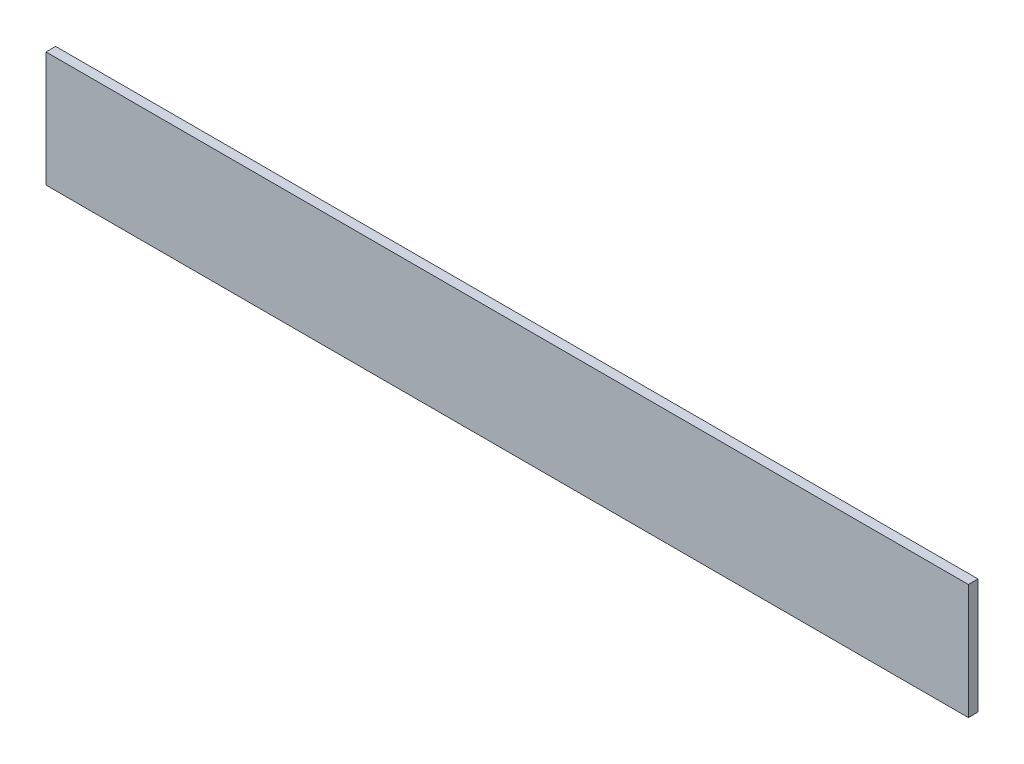
ISO-10303-21;
HEADER;
FILE_DESCRIPTION(('STEP AP214'),'2;1');
FILE_NAME('part.step','',(''),(''),'','','');
FILE_SCHEMA(('AUTOMOTIVE_DESIGN { 1 0 10303 214 1 1 1 1 }'));
ENDSEC;
DATA;
#1=APPLICATION_CONTEXT('core data for automotive mechanical design processes');
#2=APPLICATION_PROTOCOL_DEFINITION('international standard','automotive_design',2000,#1);
#3=PRODUCT_CONTEXT('',#1,'mechanical');
#4=PRODUCT('Part','Part','',(#3));
#5=PRODUCT_RELATED_PRODUCT_CATEGORY('part','',(#4));
#6=PRODUCT_DEFINITION_FORMATION('','',#4);
#7=PRODUCT_DEFINITION_CONTEXT('part definition',#1,'design');
#8=PRODUCT_DEFINITION('design','',#6,#7);
#9=PRODUCT_DEFINITION_SHAPE('','',#8);
#10=(LENGTH_UNIT() NAMED_UNIT(*) SI_UNIT(.MILLI.,.METRE.));
#11=(NAMED_UNIT(*) PLANE_ANGLE_UNIT() SI_UNIT($,.RADIAN.));
#12=(NAMED_UNIT(*) SI_UNIT($,.STERADIAN.) SOLID_ANGLE_UNIT());
#13=UNCERTAINTY_MEASURE_WITH_UNIT(LENGTH_MEASURE(1.E-05),#10,'distance_accuracy_value','');
#14=(GEOMETRIC_REPRESENTATION_CONTEXT(3) GLOBAL_UNCERTAINTY_ASSIGNED_CONTEXT((#13)) GLOBAL_UNIT_ASSIGNED_CONTEXT((#10,
#11,#12)) REPRESENTATION_CONTEXT('',''));
#15=CARTESIAN_POINT('',(0.,0.,0.));
#16=DIRECTION('',(0.,0.,1.));
#17=DIRECTION('',(1.,0.,0.));
#18=AXIS2_PLACEMENT_3D('',#15,#16,#17);
#19=CARTESIAN_POINT('',(609.6,-38.1,-3.175));
#20=DIRECTION('',(0.,0.,1.));
#21=DIRECTION('',(1.,0.,0.));
#22=AXIS2_PLACEMENT_3D('',#19,#20,#21);
#23=PLANE('',#22);
#24=DIRECTION('',(0.,1.,0.));
#25=VECTOR('',#24,1.);
#26=CARTESIAN_POINT('',(0.,-38.1,-3.175));
#27=LINE('',#26,#25);
#28=CARTESIAN_POINT('',(0.,-38.1,-3.175));
#29=VERTEX_POINT('',#28);
#30=CARTESIAN_POINT('',(0.,38.1,-3.175));
#31=VERTEX_POINT('',#30);
#32=EDGE_CURVE('E98',#29,#31,#27,.T.);
#33=ORIENTED_EDGE('',*,*,#32,.T.);
#34=DIRECTION('',(-1.,0.,0.));
#35=VECTOR('',#34,1.);
#36=CARTESIAN_POINT('',(609.6,38.1,-3.175));
#37=LINE('',#36,#35);
#38=CARTESIAN_POINT('',(609.6,38.1,-3.175));
#39=VERTEX_POINT('',#38);
#40=EDGE_CURVE('E11',#39,#31,#37,.T.);
#41=ORIENTED_EDGE('',*,*,#40,.F.);
#42=DIRECTION('',(0.,1.,0.));
#43=VECTOR('',#42,1.);
#44=CARTESIAN_POINT('',(609.6,-38.1,-3.175));
#45=LINE('',#44,#43);
#46=CARTESIAN_POINT('',(609.6,-38.1,-3.175));
#47=VERTEX_POINT('',#46);
#48=EDGE_CURVE('E86',#47,#39,#45,.T.);
#49=ORIENTED_EDGE('',*,*,#48,.F.);
#50=DIRECTION('',(-1.,0.,0.));
#51=VECTOR('',#50,1.);
#52=CARTESIAN_POINT('',(609.6,-38.1,-3.175));
#53=LINE('',#52,#51);
#54=EDGE_CURVE('E94',#47,#29,#53,.T.);
#55=ORIENTED_EDGE('',*,*,#54,.T.);
#56=EDGE_LOOP('',(#33,#41,#49,#55));
#57=FACE_BOUND('',#56,.T.);
#58=ADVANCED_FACE('F35',(#57),#23,.F.);
#59=CARTESIAN_POINT('',(609.6,38.1,3.175));
#60=DIRECTION('',(0.,-1.,0.));
#61=DIRECTION('',(0.,0.,-1.));
#62=AXIS2_PLACEMENT_3D('',#59,#60,#61);
#63=PLANE('',#62);
#64=DIRECTION('',(0.,0.,1.));
#65=VECTOR('',#64,1.);
#66=CARTESIAN_POINT('',(0.,38.1,3.175));
#67=LINE('',#66,#65);
#68=CARTESIAN_POINT('',(0.,38.1,3.175));
#69=VERTEX_POINT('',#68);
#70=EDGE_CURVE('E90',#31,#69,#67,.T.);
#71=ORIENTED_EDGE('',*,*,#70,.T.);
#72=DIRECTION('',(-1.,0.,0.));
#73=VECTOR('',#72,1.);
#74=CARTESIAN_POINT('',(609.6,38.1,3.175));
#75=LINE('',#74,#73);
#76=CARTESIAN_POINT('',(609.6,38.1,3.175));
#77=VERTEX_POINT('',#76);
#78=EDGE_CURVE('E43',#77,#69,#75,.T.);
#79=ORIENTED_EDGE('',*,*,#78,.F.);
#80=DIRECTION('',(0.,0.,1.));
#81=VECTOR('',#80,1.);
#82=CARTESIAN_POINT('',(609.6,38.1,3.175));
#83=LINE('',#82,#81);
#84=EDGE_CURVE('E81',#39,#77,#83,.T.);
#85=ORIENTED_EDGE('',*,*,#84,.F.);
#86=ORIENTED_EDGE('',*,*,#40,.T.);
#87=EDGE_LOOP('',(#71,#79,#85,#86));
#88=FACE_BOUND('',#87,.T.);
#89=ADVANCED_FACE('F89',(#88),#63,.F.);
#90=CARTESIAN_POINT('',(609.6,-38.1,3.175));
#91=DIRECTION('',(0.,0.,-1.));
#92=DIRECTION('',(-1.,0.,0.));
#93=AXIS2_PLACEMENT_3D('',#90,#91,#92);
#94=PLANE('',#93);
#95=DIRECTION('',(0.,-1.,0.));
#96=VECTOR('',#95,1.);
#97=CARTESIAN_POINT('',(0.,-38.1,3.175));
#98=LINE('',#97,#96);
#99=CARTESIAN_POINT('',(0.,-38.1,3.175));
#100=VERTEX_POINT('',#99);
#101=EDGE_CURVE('E68',#69,#100,#98,.T.);
#102=ORIENTED_EDGE('',*,*,#101,.T.);
#103=DIRECTION('',(-1.,0.,0.));
#104=VECTOR('',#103,1.);
#105=CARTESIAN_POINT('',(609.6,-38.1,3.175));
#106=LINE('',#105,#104);
#107=CARTESIAN_POINT('',(609.6,-38.1,3.175));
#108=VERTEX_POINT('',#107);
#109=EDGE_CURVE('E91',#108,#100,#106,.T.);
#110=ORIENTED_EDGE('',*,*,#109,.F.);
#111=DIRECTION('',(0.,-1.,0.));
#112=VECTOR('',#111,1.);
#113=CARTESIAN_POINT('',(609.6,-38.1,3.175));
#114=LINE('',#113,#112);
#115=EDGE_CURVE('E84',#77,#108,#114,.T.);
#116=ORIENTED_EDGE('',*,*,#115,.F.);
#117=ORIENTED_EDGE('',*,*,#78,.T.);
#118=EDGE_LOOP('',(#102,#110,#116,#117));
#119=FACE_BOUND('',#118,.T.);
#120=ADVANCED_FACE('F92',(#119),#94,.F.);
#121=CARTESIAN_POINT('',(609.6,-38.1,3.175));
#122=DIRECTION('',(0.,1.,0.));
#123=DIRECTION('',(0.,0.,1.));
#124=AXIS2_PLACEMENT_3D('',#121,#122,#123);
#125=PLANE('',#124);
#126=DIRECTION('',(0.,0.,-1.));
#127=VECTOR('',#126,1.);
#128=CARTESIAN_POINT('',(0.,-38.1,3.175));
#129=LINE('',#128,#127);
#130=EDGE_CURVE('E74',#100,#29,#129,.T.);
#131=ORIENTED_EDGE('',*,*,#130,.T.);
#132=ORIENTED_EDGE('',*,*,#54,.F.);
#133=DIRECTION('',(0.,0.,-1.));
#134=VECTOR('',#133,1.);
#135=CARTESIAN_POINT('',(609.6,-38.1,3.175));
#136=LINE('',#135,#134);
#137=EDGE_CURVE('E51',#108,#47,#136,.T.);
#138=ORIENTED_EDGE('',*,*,#137,.F.);
#139=ORIENTED_EDGE('',*,*,#109,.T.);
#140=EDGE_LOOP('',(#131,#132,#138,#139));
#141=FACE_BOUND('',#140,.T.);
#142=ADVANCED_FACE('F105',(#141),#125,.F.);
#143=CARTESIAN_POINT('',(609.6,0.,0.));
#144=DIRECTION('',(-1.,0.,0.));
#145=DIRECTION('',(0.,0.,1.));
#146=AXIS2_PLACEMENT_3D('',#143,#144,#145);
#147=PLANE('',#146);
#148=ORIENTED_EDGE('',*,*,#48,.T.);
#149=ORIENTED_EDGE('',*,*,#84,.T.);
#150=ORIENTED_EDGE('',*,*,#115,.T.);
#151=ORIENTED_EDGE('',*,*,#137,.T.);
#152=EDGE_LOOP('',(#148,#149,#150,#151));
#153=FACE_BOUND('',#152,.T.);
#154=ADVANCED_FACE('F82',(#153),#147,.F.);
#155=CARTESIAN_POINT('',(0.,0.,0.));
#156=DIRECTION('',(-1.,0.,0.));
#157=DIRECTION('',(0.,0.,1.));
#158=AXIS2_PLACEMENT_3D('',#155,#156,#157);
#159=PLANE('',#158);
#160=ORIENTED_EDGE('',*,*,#32,.F.);
#161=ORIENTED_EDGE('',*,*,#130,.F.);
#162=ORIENTED_EDGE('',*,*,#101,.F.);
#163=ORIENTED_EDGE('',*,*,#70,.F.);
#164=EDGE_LOOP('',(#160,#161,#162,#163));
#165=FACE_BOUND('',#164,.T.);
#166=ADVANCED_FACE('F108',(#165),#159,.T.);
#167=CLOSED_SHELL('',(#58,#89,#120,#142,#154,#166));
#168=MANIFOLD_SOLID_BREP('B2',#167);
#169=ADVANCED_BREP_SHAPE_REPRESENTATION('',(#18,#168),#14);
#170=SHAPE_DEFINITION_REPRESENTATION(#9,#169);
ENDSEC;
END-ISO-10303-21;
